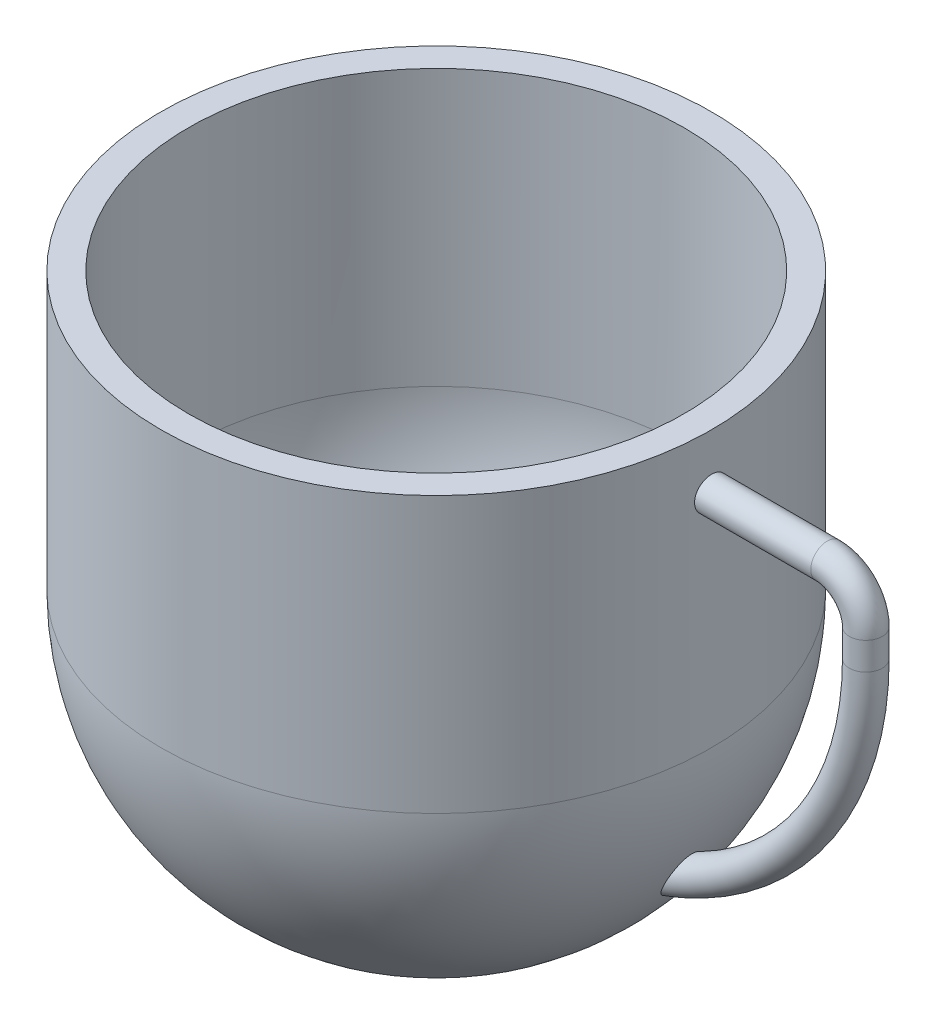
ISO-10303-21;
HEADER;
FILE_DESCRIPTION(('STEP AP214'),'2;1');
FILE_NAME('part.step','',(''),(''),'','','');
FILE_SCHEMA(('AUTOMOTIVE_DESIGN { 1 0 10303 214 1 1 1 1 }'));
ENDSEC;
DATA;
#1=APPLICATION_CONTEXT('core data for automotive mechanical design processes');
#2=APPLICATION_PROTOCOL_DEFINITION('international standard','automotive_design',2000,#1);
#3=PRODUCT_CONTEXT('',#1,'mechanical');
#4=PRODUCT('Part','Part','',(#3));
#5=PRODUCT_RELATED_PRODUCT_CATEGORY('part','',(#4));
#6=PRODUCT_DEFINITION_FORMATION('','',#4);
#7=PRODUCT_DEFINITION_CONTEXT('part definition',#1,'design');
#8=PRODUCT_DEFINITION('design','',#6,#7);
#9=PRODUCT_DEFINITION_SHAPE('','',#8);
#10=(LENGTH_UNIT() NAMED_UNIT(*) SI_UNIT(.MILLI.,.METRE.));
#11=(NAMED_UNIT(*) PLANE_ANGLE_UNIT() SI_UNIT($,.RADIAN.));
#12=(NAMED_UNIT(*) SI_UNIT($,.STERADIAN.) SOLID_ANGLE_UNIT());
#13=UNCERTAINTY_MEASURE_WITH_UNIT(LENGTH_MEASURE(1.E-05),#10,'distance_accuracy_value','');
#14=(GEOMETRIC_REPRESENTATION_CONTEXT(3) GLOBAL_UNCERTAINTY_ASSIGNED_CONTEXT((#13)) GLOBAL_UNIT_ASSIGNED_CONTEXT((#10,
#11,#12)) REPRESENTATION_CONTEXT('',''));
#15=CARTESIAN_POINT('',(0.,0.,0.));
#16=DIRECTION('',(0.,0.,1.));
#17=DIRECTION('',(1.,0.,0.));
#18=AXIS2_PLACEMENT_3D('',#15,#16,#17);
#19=CARTESIAN_POINT('',(-40.1014977724918,45.,0.));
#20=DIRECTION('',(0.,-1.,0.));
#21=DIRECTION('',(0.,0.,-1.));
#22=AXIS2_PLACEMENT_3D('',#19,#20,#21);
#23=PLANE('',#22);
#24=CARTESIAN_POINT('',(-40.1014977724918,45.,0.));
#25=DIRECTION('',(0.,-1.,0.));
#26=DIRECTION('',(0.,0.,-1.));
#27=AXIS2_PLACEMENT_3D('',#24,#25,#26);
#28=CIRCLE('',#27,45.);
#29=CARTESIAN_POINT('',(-40.1014977724918,45.,-45.));
#30=VERTEX_POINT('',#29);
#31=EDGE_CURVE('E101',#30,#30,#28,.F.);
#32=ORIENTED_EDGE('',*,*,#31,.F.);
#33=EDGE_LOOP('',(#32));
#34=FACE_BOUND('',#33,.T.);
#35=CARTESIAN_POINT('',(-40.1014977724918,45.,0.));
#36=DIRECTION('',(0.,1.,0.));
#37=DIRECTION('',(0.,0.,1.));
#38=AXIS2_PLACEMENT_3D('',#35,#36,#37);
#39=CIRCLE('',#38,50.);
#40=CARTESIAN_POINT('',(-40.1014977724918,45.,50.));
#41=VERTEX_POINT('',#40);
#42=EDGE_CURVE('E10',#41,#41,#39,.T.);
#43=ORIENTED_EDGE('',*,*,#42,.T.);
#44=EDGE_LOOP('',(#43));
#45=FACE_BOUND('',#44,.T.);
#46=ADVANCED_FACE('F39',(#34,#45),#23,.F.);
#47=CARTESIAN_POINT('',(-40.1014977724918,45.,0.));
#48=DIRECTION('',(0.,1.,0.));
#49=DIRECTION('',(0.,0.,1.));
#50=AXIS2_PLACEMENT_3D('',#47,#48,#49);
#51=CYLINDRICAL_SURFACE('',#50,50.);
#52=CARTESIAN_POINT('',(9.80842108137937,35.,-3.));
#53=CARTESIAN_POINT('',(9.80842228757156,34.831651484992,-2.99999258735707));
#54=CARTESIAN_POINT('',(9.80928201143458,34.6631847629596,-2.98578177447834));
#55=CARTESIAN_POINT('',(9.8126284601874,34.3309021525766,-2.92929548415804));
#56=CARTESIAN_POINT('',(9.81511708385479,34.1670919250254,-2.88698725324678));
#57=CARTESIAN_POINT('',(9.82143843308454,33.8489836185765,-2.77552488995124));
#58=CARTESIAN_POINT('',(9.82527045434982,33.694680605116,-2.70638482254646));
#59=CARTESIAN_POINT('',(9.83384592528368,33.3999109854946,-2.54324392374022));
#60=CARTESIAN_POINT('',(9.83858916478271,33.259441200023,-2.44924882319397));
#61=CARTESIAN_POINT('',(9.84846012193941,32.9960886661017,-2.23892176408542));
#62=CARTESIAN_POINT('',(9.85358830525923,32.87322775886,-2.12256247754005));
#63=CARTESIAN_POINT('',(9.863646973824,32.6487673381792,-1.87086613571391));
#64=CARTESIAN_POINT('',(9.8685774508547,32.5471687074034,-1.73552829296343));
#65=CARTESIAN_POINT('',(9.87768906917889,32.3680513179128,-1.44959535041678));
#66=CARTESIAN_POINT('',(9.8818696549077,32.2905503813011,-1.29898906707195));
#67=CARTESIAN_POINT('',(9.88900556171962,32.1619425161186,-0.986872903133912));
#68=CARTESIAN_POINT('',(9.89196089508004,32.1108353230749,-0.825363131815116));
#69=CARTESIAN_POINT('',(9.89631009904479,32.0365256087849,-0.496232865556627));
#70=CARTESIAN_POINT('',(9.89770586370015,32.0132892367073,-0.328620038744655));
#71=CARTESIAN_POINT('',(9.89878502834491,31.9952762381356,0.00813239348195096));
#72=CARTESIAN_POINT('',(9.8984684463677,32.0004993119241,0.177271982798926));
#73=CARTESIAN_POINT('',(9.89616017436149,32.039228982085,0.512047418202575));
#74=CARTESIAN_POINT('',(9.89417064123007,32.0726991603159,0.677687494381374));
#75=CARTESIAN_POINT('',(9.88874296305051,32.166916442674,1.00099401164867));
#76=CARTESIAN_POINT('',(9.88530480997729,32.2276636979114,1.15866040855898));
#77=CARTESIAN_POINT('',(9.87736332946055,32.3747520429396,1.46166097965742));
#78=CARTESIAN_POINT('',(9.87285931472218,32.4611096560792,1.60698711402266));
#79=CARTESIAN_POINT('',(9.86329307385402,32.6569553103961,1.88109406743768));
#80=CARTESIAN_POINT('',(9.85823084195205,32.7664435907644,2.00987471537073));
#81=CARTESIAN_POINT('',(9.84810854611258,33.0056483341855,2.24744760953885));
#82=CARTESIAN_POINT('',(9.84304849816425,33.1353964038297,2.35620803529859));
#83=CARTESIAN_POINT('',(9.83350902093594,33.411326854707,2.55040788067334));
#84=CARTESIAN_POINT('',(9.82902959186826,33.5575092419497,2.63584729176061));
#85=CARTESIAN_POINT('',(9.8211571362296,33.8621787500797,2.78097741848751));
#86=CARTESIAN_POINT('',(9.81776416489078,34.0206664960248,2.84066682512985));
#87=CARTESIAN_POINT('',(9.81244925535338,34.3454386931891,2.93258076589739));
#88=CARTESIAN_POINT('',(9.81052730121248,34.5117230598908,2.96480559767352));
#89=CARTESIAN_POINT('',(9.80837414821009,34.8470908115382,3.00083606245594));
#90=CARTESIAN_POINT('',(9.80814031870359,35.0161694297883,3.00468591307));
#91=CARTESIAN_POINT('',(9.80938291313263,35.3525700810831,2.98397263230762));
#92=CARTESIAN_POINT('',(9.81085932887657,35.5198921225375,2.95940963702078));
#93=CARTESIAN_POINT('',(9.81535362373589,35.8479051017855,2.8826046361301));
#94=CARTESIAN_POINT('',(9.81837037019944,36.0086008184103,2.83038296773509));
#95=CARTESIAN_POINT('',(9.82560438936462,36.3189470245195,2.69976359803359));
#96=CARTESIAN_POINT('',(9.82982167209902,36.468597421686,2.62136567797357));
#97=CARTESIAN_POINT('',(9.83898788177296,36.7528081428951,2.4405061331126));
#98=CARTESIAN_POINT('',(9.84393770722534,36.8873495731967,2.33801486404898));
#99=CARTESIAN_POINT('',(9.85400803197269,37.1373329538843,2.11192115304356));
#100=CARTESIAN_POINT('',(9.85912853281195,37.2527747313989,1.9883185200426));
#101=CARTESIAN_POINT('',(9.8689708618736,37.4614310281652,1.72332048471518));
#102=CARTESIAN_POINT('',(9.87369217209502,37.5546169450938,1.58190253941366));
#103=CARTESIAN_POINT('',(9.88219666230186,37.7159206328346,1.28540170667705));
#104=CARTESIAN_POINT('',(9.88597984770487,37.7840385484133,1.13031889816233));
#105=CARTESIAN_POINT('',(9.89217931420951,37.8932228070233,0.810995995212355));
#106=CARTESIAN_POINT('',(9.89459651200776,37.9343072948891,0.646762123442668));
#107=CARTESIAN_POINT('',(9.89779527966352,37.988317849945,0.313712443524316));
#108=CARTESIAN_POINT('',(9.89857686411751,38.0012441684231,0.144896676278834));
#109=CARTESIAN_POINT('',(9.8984163835799,37.9985690403185,-0.192241466492349));
#110=CARTESIAN_POINT('',(9.89747702444718,37.9830123778693,-0.360564200493613));
#111=CARTESIAN_POINT('',(9.89398568167462,37.9239056790188,-0.692203138100701));
#112=CARTESIAN_POINT('',(9.89143369515035,37.8803555925468,-0.855519332750976));
#113=CARTESIAN_POINT('',(9.88500399818113,37.7665081967466,-1.17251650153881));
#114=CARTESIAN_POINT('',(9.88112629233159,37.6962109801334,-1.32619750907319));
#115=CARTESIAN_POINT('',(9.8724806912444,37.5308712881414,-1.61958098916875));
#116=CARTESIAN_POINT('',(9.86771282001731,37.435829480175,-1.75928383860883));
#117=CARTESIAN_POINT('',(9.85781442260251,37.2235338287435,-2.02097192252031));
#118=CARTESIAN_POINT('',(9.85268337780944,37.1062478028087,-2.14293102826392));
#119=CARTESIAN_POINT('',(9.84264097170471,36.8528326108917,-2.36547027124281));
#120=CARTESIAN_POINT('',(9.83772966452625,36.7166988351478,-2.46604516304507));
#121=CARTESIAN_POINT('',(9.82867629029365,36.4293075100479,-2.64302952266152));
#122=CARTESIAN_POINT('',(9.82453513725406,36.2780323141879,-2.71941035171419));
#123=CARTESIAN_POINT('',(9.81750276435452,35.9648907602909,-2.84559604482191));
#124=CARTESIAN_POINT('',(9.81461007857711,35.803037081881,-2.89543209325468));
#125=CARTESIAN_POINT('',(9.81116168385193,35.5334914934641,-2.95413467297801));
#126=CARTESIAN_POINT('',(9.81013853735397,35.4275427302629,-2.97131199106155));
#127=CARTESIAN_POINT('',(9.80876785240396,35.2144119628455,-2.99424700805968));
#128=CARTESIAN_POINT('',(9.80842031309257,35.1072299601981,-3.00000472149936));
#129=CARTESIAN_POINT('',(9.80842108137937,35.,-3.));
#130=B_SPLINE_CURVE_WITH_KNOTS('',3,(#52,#53,#54,#55,#56,#57,#58,#59,#60,#61,#62,#63,#64,#65,
#66,#67,#68,#69,#70,#71,#72,#73,#74,#75,#76,#77,#78,#79,#80,#81,#82,#83,#84,#85,#86,#87,#88,#89,
#90,#91,#92,#93,#94,#95,#96,#97,#98,#99,#100,#101,#102,#103,#104,#105,#106,#107,#108,#109,#110,
#111,#112,#113,#114,#115,#116,#117,#118,#119,#120,#121,#122,#123,#124,#125,#126,#127,#128,#129),
.UNSPECIFIED.,.T.,.F.,(4,2,2,2,2,2,2,2,2,2,2,2,2,2,2,2,2,2,2,2,2,2,2,2,2,2,2,2,2,2,2,2,2,2,2,2,
2,2,4),(0.,0.504654094410833,1.00989750469077,1.51487642839874,2.01973901987436,
2.52522249762362,3.03072695540782,3.53660438832692,4.04247675211106,4.54773407852321,
5.05298608388374,5.5575876764176,6.06219206439061,6.56712272507959,7.07205860744167,
7.5777902413209,8.08352206012947,8.58927958470435,9.0950316279961,9.59999537532429,
10.1049567040272,10.6095472529766,11.1141420188672,11.619360913985,12.1245843816075,
12.630453689427,13.1363200758289,13.6418465774614,14.147368567676,14.6520964020586,
15.1568251392307,15.6615521268507,16.1662655023595,16.6717147352076,17.1772878093688,
17.6834571183417,18.1890304689197,18.5104714230321,18.8319119682899),.UNSPECIFIED.);
#131=CARTESIAN_POINT('',(9.80842108137937,35.,-3.));
#132=VERTEX_POINT('',#131);
#133=EDGE_CURVE('E42',#132,#132,#130,.T.);
#134=ORIENTED_EDGE('',*,*,#133,.T.);
#135=EDGE_LOOP('',(#134));
#136=FACE_BOUND('',#135,.T.);
#137=ORIENTED_EDGE('',*,*,#42,.F.);
#138=EDGE_LOOP('',(#137));
#139=FACE_BOUND('',#138,.T.);
#140=CARTESIAN_POINT('',(-40.1014977724918,-5.,0.));
#141=DIRECTION('',(0.,1.,0.));
#142=DIRECTION('',(0.,0.,1.));
#143=AXIS2_PLACEMENT_3D('',#140,#141,#142);
#144=CIRCLE('',#143,50.);
#145=CARTESIAN_POINT('',(-40.1014977724918,-5.,50.));
#146=VERTEX_POINT('',#145);
#147=EDGE_CURVE('E51',#146,#146,#144,.T.);
#148=ORIENTED_EDGE('',*,*,#147,.T.);
#149=EDGE_LOOP('',(#148));
#150=FACE_BOUND('',#149,.T.);
#151=ADVANCED_FACE('F89',(#136,#139,#150),#51,.T.);
#152=CARTESIAN_POINT('',(-40.1014977724917,-5.00000000000001,0.));
#153=DIRECTION('',(0.,1.,0.));
#154=DIRECTION('',(1.,0.,0.));
#155=AXIS2_PLACEMENT_3D('',#152,#153,#154);
#156=SPHERICAL_SURFACE('',#155,50.);
#157=CARTESIAN_POINT('',(2.36685182323063,-31.3621639015179,-1.21474155482296));
#158=CARTESIAN_POINT('',(2.33339377102615,-31.4206156711443,-1.11594434784123));
#159=CARTESIAN_POINT('',(2.30318580158751,-31.4732311780174,-1.01249816781997));
#160=CARTESIAN_POINT('',(2.25097678219428,-31.5640044394216,-0.79741453632292));
#161=CARTESIAN_POINT('',(2.2289749363498,-31.602163596041,-0.685777880476854));
#162=CARTESIAN_POINT('',(2.1946716600698,-31.6615987148694,-0.455740794563823));
#163=CARTESIAN_POINT('',(2.18243657584606,-31.6827592101764,-0.337299865972679));
#164=CARTESIAN_POINT('',(2.16903730951416,-31.7059310409794,-0.0979617006950265));
#165=CARTESIAN_POINT('',(2.16786639642714,-31.7079540189412,0.0229339977395175));
#166=CARTESIAN_POINT('',(2.17636958604479,-31.6932515888475,0.254470402580145));
#167=CARTESIAN_POINT('',(2.18527683256257,-31.6778518943411,0.365227981846171));
#168=CARTESIAN_POINT('',(2.21198823950613,-31.6316034459842,0.582334638507805));
#169=CARTESIAN_POINT('',(2.22979686690689,-31.6007469354315,0.688681473414391));
#170=CARTESIAN_POINT('',(2.27871873314462,-31.5158048245661,0.921484960087241));
#171=CARTESIAN_POINT('',(2.31208249189751,-31.4577741144724,1.04602265724754));
#172=CARTESIAN_POINT('',(2.38826445985376,-31.3248022642068,1.28250993096155));
#173=CARTESIAN_POINT('',(2.43109868095901,-31.2498324800347,1.39443769798558));
#174=CARTESIAN_POINT('',(2.54249013039062,-31.0540634151513,1.64779289978154));
#175=CARTESIAN_POINT('',(2.61444449482488,-30.9269914735671,1.7828442631198));
#176=CARTESIAN_POINT('',(2.76705246249198,-30.6556480163927,2.02844775693629));
#177=CARTESIAN_POINT('',(2.84772252807425,-30.5113438963308,2.13895227658724));
#178=CARTESIAN_POINT('',(2.99354761094856,-30.2485724566808,2.31275210925573));
#179=CARTESIAN_POINT('',(3.05755438367211,-30.1326371895259,2.38094798054601));
#180=CARTESIAN_POINT('',(3.18763171868377,-29.8956850797717,2.50565214589872));
#181=CARTESIAN_POINT('',(3.25370324454609,-29.7746658552516,2.56215488637773));
#182=CARTESIAN_POINT('',(3.3872328593857,-29.5286407282985,2.6642679574471));
#183=CARTESIAN_POINT('',(3.45469278675742,-29.4036294005972,2.70986268197537));
#184=CARTESIAN_POINT('',(3.5903432638349,-29.1507219232479,2.79067822049346));
#185=CARTESIAN_POINT('',(3.65853377646318,-29.0228259196377,2.82589955837616));
#186=CARTESIAN_POINT('',(3.81753270173147,-28.7227528440585,2.89635115178366));
#187=CARTESIAN_POINT('',(3.90845752134334,-28.5497503491889,2.92783061539403));
#188=CARTESIAN_POINT('',(4.09002527304536,-28.2013511856449,2.97417955517934));
#189=CARTESIAN_POINT('',(4.18066809255123,-28.0259536819291,2.98904308021307));
#190=CARTESIAN_POINT('',(4.36102389096534,-27.6739513824107,3.00254373700256));
#191=CARTESIAN_POINT('',(4.45073636874454,-27.4973460131589,3.0011725364765));
#192=CARTESIAN_POINT('',(4.62855867474284,-27.1442430483086,2.98223062204596));
#193=CARTESIAN_POINT('',(4.71666893801279,-26.9677454364205,2.96466437465449));
#194=CARTESIAN_POINT('',(4.87653715551445,-26.6447127502759,2.9172312238169));
#195=CARTESIAN_POINT('',(4.94862317558161,-26.4979750300156,2.88983072976635));
#196=CARTESIAN_POINT('',(5.09089132626545,-26.2062659971974,2.82306509808707));
#197=CARTESIAN_POINT('',(5.16107326200354,-26.0612948662758,2.78369874077432));
#198=CARTESIAN_POINT('',(5.29893782213588,-25.7744609208527,2.69250129276633));
#199=CARTESIAN_POINT('',(5.36662513089956,-25.6325925078255,2.64069509836651));
#200=CARTESIAN_POINT('',(5.49904693534462,-25.3530860351672,2.52379266970333));
#201=CARTESIAN_POINT('',(5.56378297410793,-25.2154457774003,2.45870348030143));
#202=CARTESIAN_POINT('',(5.70355497647905,-24.9162347496809,2.29814872604962));
#203=CARTESIAN_POINT('',(5.77769987228327,-24.7561090668689,2.19914852039385));
#204=CARTESIAN_POINT('',(5.91857376716742,-24.449514899494,1.97737790724117));
#205=CARTESIAN_POINT('',(5.98531146100398,-24.3030304357665,1.85463584303978));
#206=CARTESIAN_POINT('',(6.09295918146451,-24.0651610621836,1.61700763750033));
#207=CARTESIAN_POINT('',(6.13615573129295,-23.9691548291375,1.50782383680991));
#208=CARTESIAN_POINT('',(6.21475632645367,-23.793710217727,1.27429966254489));
#209=CARTESIAN_POINT('',(6.25017258760842,-23.714245877389,1.1499835322096));
#210=CARTESIAN_POINT('',(6.30414200350778,-23.5927723577378,0.916148010261146));
#211=CARTESIAN_POINT('',(6.32469086916808,-23.5463691666118,0.809389443776511));
#212=CARTESIAN_POINT('',(6.35834063990187,-23.4702577907446,0.588933439388094));
#213=CARTESIAN_POINT('',(6.37144782021087,-23.4405355399675,0.475241937583697));
#214=CARTESIAN_POINT('',(6.38925465793698,-23.4001325447827,0.24310714545916));
#215=CARTESIAN_POINT('',(6.39390388819086,-23.3895660100076,0.124639631425891));
#216=CARTESIAN_POINT('',(6.39421025234914,-23.3888701825868,-0.112364317106835));
#217=CARTESIAN_POINT('',(6.38986841314334,-23.3987385560253,-0.230900742189997));
#218=CARTESIAN_POINT('',(6.37337999629064,-23.4361525676269,-0.453491015276546));
#219=CARTESIAN_POINT('',(6.36196910532469,-23.462031642551,-0.557889668085098));
#220=CARTESIAN_POINT('',(6.33280936361999,-23.5280187698766,-0.761107586040868));
#221=CARTESIAN_POINT('',(6.31505795820391,-23.5681325575902,-0.859924583651999));
#222=CARTESIAN_POINT('',(6.26592853086548,-23.6788372633682,-1.08886142950339));
#223=CARTESIAN_POINT('',(6.23194087875116,-23.7551986210318,-1.21562832032603));
#224=CARTESIAN_POINT('',(6.15582698396559,-23.9253410486851,-1.45410243875196));
#225=CARTESIAN_POINT('',(6.11368295256752,-24.0191601757966,-1.56577582706339));
#226=CARTESIAN_POINT('',(6.00202354047944,-24.2663059099796,-1.82321998169622));
#227=CARTESIAN_POINT('',(5.92893543595646,-24.4269181101764,-1.96045121942669));
#228=CARTESIAN_POINT('',(5.81262232800559,-24.6801265590547,-2.14446103691651));
#229=CARTESIAN_POINT('',(5.77267724146548,-24.766707453812,-2.20222355887092));
#230=CARTESIAN_POINT('',(5.69086861745688,-24.9432013798254,-2.31090478925553));
#231=CARTESIAN_POINT('',(5.64900552703741,-25.0331136336819,-2.36182508170229));
#232=CARTESIAN_POINT('',(5.5421177357069,-25.2615850893335,-2.48125951958151));
#233=CARTESIAN_POINT('',(5.4760643265195,-25.401799276013,-2.54568718091045));
#234=CARTESIAN_POINT('',(5.34101694757757,-25.6863517519179,-2.66098747598898));
#235=CARTESIAN_POINT('',(5.27202154610065,-25.8306920375859,-2.71185342054304));
#236=CARTESIAN_POINT('',(5.1316146802185,-26.1222378850899,-2.800854623802));
#237=CARTESIAN_POINT('',(5.06020118037659,-26.2694458141635,-2.83897884821951));
#238=CARTESIAN_POINT('',(4.9154838599948,-26.5655292485963,-2.90301377290536));
#239=CARTESIAN_POINT('',(4.84218032745359,-26.7144044979603,-2.9289263224943));
#240=CARTESIAN_POINT('',(4.69138781729493,-27.0183759400924,-2.96964036551142));
#241=CARTESIAN_POINT('',(4.61384328393594,-27.1735026566941,-2.98400687566681));
#242=CARTESIAN_POINT('',(4.45753267266801,-27.4838093375329,-3.00022895272352));
#243=CARTESIAN_POINT('',(4.3787664758206,-27.638989305498,-3.00208329370652));
#244=CARTESIAN_POINT('',(4.22045773976511,-27.9485268385973,-2.99325968321055));
#245=CARTESIAN_POINT('',(4.14091549157463,-28.1028846808162,-2.9825862630632));
#246=CARTESIAN_POINT('',(3.98148055585738,-28.4099906204337,-2.94848710202077));
#247=CARTESIAN_POINT('',(3.90158792423138,-28.5627389622667,-2.92506332682425));
#248=CARTESIAN_POINT('',(3.75250971460854,-28.845706771859,-2.86898327152443));
#249=CARTESIAN_POINT('',(3.68330313637057,-28.9762380812403,-2.83795423594136));
#250=CARTESIAN_POINT('',(3.54542038410657,-29.2347117824637,-2.7655102727417));
#251=CARTESIAN_POINT('',(3.476744261522,-29.3626539251204,-2.72409435056366));
#252=CARTESIAN_POINT('',(3.34048484914066,-29.6150014979831,-2.63032159763962));
#253=CARTESIAN_POINT('',(3.27290100343819,-29.739408753357,-2.57797053409569));
#254=CARTESIAN_POINT('',(3.13950461038493,-29.9835730037165,-2.4616095371304));
#255=CARTESIAN_POINT('',(3.07369125498367,-30.1033321315457,-2.39760502961954));
#256=CARTESIAN_POINT('',(2.92334097557532,-30.3754536627599,-2.23379612178189));
#257=CARTESIAN_POINT('',(2.8398038505227,-30.525511765559,-2.12915085659554));
#258=CARTESIAN_POINT('',(2.68060606004607,-30.8096582532967,-1.89553267889366));
#259=CARTESIAN_POINT('',(2.60491780495336,-30.9438028334046,-1.76664979592963));
#260=CARTESIAN_POINT('',(2.50453796735331,-31.1207760297676,-1.56163988262347));
#261=CARTESIAN_POINT('',(2.47485807857124,-31.1729634260235,-1.49593516315151));
#262=CARTESIAN_POINT('',(2.41846779750364,-31.271902206488,-1.35926174556061));
#263=CARTESIAN_POINT('',(2.39175923450974,-31.3186502427676,-1.28828984904171));
#264=CARTESIAN_POINT('',(2.36685182323063,-31.3621639015179,-1.21474155482296));
#265=B_SPLINE_CURVE_WITH_KNOTS('',3,(#157,#158,#159,#160,#161,#162,#163,#164,#165,#166,#167,
#168,#169,#170,#171,#172,#173,#174,#175,#176,#177,#178,#179,#180,#181,#182,#183,#184,#185,#186,
#187,#188,#189,#190,#191,#192,#193,#194,#195,#196,#197,#198,#199,#200,#201,#202,#203,#204,#205,
#206,#207,#208,#209,#210,#211,#212,#213,#214,#215,#216,#217,#218,#219,#220,#221,#222,#223,#224,
#225,#226,#227,#228,#229,#230,#231,#232,#233,#234,#235,#236,#237,#238,#239,#240,#241,#242,#243,
#244,#245,#246,#247,#248,#249,#250,#251,#252,#253,#254,#255,#256,#257,#258,#259,#260,#261,#262,
#263,#264),.UNSPECIFIED.,.T.,.F.,(4,2,2,2,2,2,2,2,2,2,2,2,2,2,2,2,2,2,2,2,2,2,2,2,2,2,2,2,2,2,2,
2,2,2,2,2,2,2,2,2,2,2,2,2,2,2,2,2,2,2,2,2,2,4),(0.,0.358479558179919,0.716924339343617,
1.07778381640812,1.43842374751829,1.77336494173791,2.10847438831741,2.53031530526211,
2.9528749665944,3.5463256598261,4.14091754432209,4.58721844150093,5.0337308226383,
5.48087825757185,5.92800310609737,6.52109534509911,7.11439993719466,7.70800904908315,
8.30145449550363,8.79834335634251,9.29528288220565,9.79123603479462,10.2869268306603,
10.8923161192808,11.4969870988752,11.9505474926965,12.4033905797288,12.7566171884442,
13.1095454931025,13.4645711813909,13.8195563236518,14.142671723054,14.4659174570616,
14.9188893464804,15.3728605142717,16.0395345937954,16.3738078742964,16.7080036347373,
17.2108242749983,17.7138924701363,18.2173951986002,18.7208216527258,19.242425860063,
19.7640811724369,20.2855478585325,20.8069341738371,21.2594833587704,21.712075892586,
22.1644303287211,22.6165746821479,23.2181368518276,23.8175071675748,24.0842093100683,
24.3510747491014),.UNSPECIFIED.);
#266=CARTESIAN_POINT('',(2.36685182323063,-31.3621639015179,-1.21474155482296));
#267=VERTEX_POINT('',#266);
#268=EDGE_CURVE('E60',#267,#267,#265,.T.);
#269=ORIENTED_EDGE('',*,*,#268,.T.);
#270=EDGE_LOOP('',(#269));
#271=FACE_BOUND('',#270,.T.);
#272=ORIENTED_EDGE('',*,*,#147,.F.);
#273=EDGE_LOOP('',(#272));
#274=FACE_BOUND('',#273,.T.);
#275=CARTESIAN_POINT('',(-40.1014977724918,-45.,0.));
#276=DIRECTION('',(0.,1.,0.));
#277=DIRECTION('',(0.,0.,1.));
#278=AXIS2_PLACEMENT_3D('',#275,#276,#277);
#279=CIRCLE('',#278,30.);
#280=CARTESIAN_POINT('',(-40.1014977724918,-45.,30.));
#281=VERTEX_POINT('',#280);
#282=EDGE_CURVE('E57',#281,#281,#279,.T.);
#283=ORIENTED_EDGE('',*,*,#282,.T.);
#284=EDGE_LOOP('',(#283));
#285=FACE_BOUND('',#284,.T.);
#286=ADVANCED_FACE('F69',(#271,#274,#285),#156,.T.);
#287=CARTESIAN_POINT('',(-40.1014977724918,-45.,0.));
#288=DIRECTION('',(0.,1.,0.));
#289=DIRECTION('',(0.,0.,1.));
#290=AXIS2_PLACEMENT_3D('',#287,#288,#289);
#291=PLANE('',#290);
#292=CARTESIAN_POINT('',(-40.1014977724918,-45.,0.));
#293=DIRECTION('',(0.,-1.,0.));
#294=DIRECTION('',(0.,0.,-1.));
#295=AXIS2_PLACEMENT_3D('',#292,#293,#294);
#296=CIRCLE('',#295,28.);
#297=CARTESIAN_POINT('',(-40.1014977724918,-45.,-28.));
#298=VERTEX_POINT('',#297);
#299=EDGE_CURVE('E110',#298,#298,#296,.T.);
#300=ORIENTED_EDGE('',*,*,#299,.F.);
#301=EDGE_LOOP('',(#300));
#302=FACE_BOUND('',#301,.T.);
#303=ORIENTED_EDGE('',*,*,#282,.F.);
#304=EDGE_LOOP('',(#303));
#305=FACE_BOUND('',#304,.T.);
#306=ADVANCED_FACE('F81',(#302,#305),#291,.F.);
#307=CARTESIAN_POINT('',(7.89850222750824,35.,0.));
#308=DIRECTION('',(1.,0.,0.));
#309=DIRECTION('',(0.,0.,-1.));
#310=AXIS2_PLACEMENT_3D('',#307,#308,#309);
#311=CYLINDRICAL_SURFACE('',#310,3.);
#312=CARTESIAN_POINT('',(30.8985022275082,35.,0.));
#313=DIRECTION('',(1.,0.,0.));
#314=DIRECTION('',(0.,0.,-1.));
#315=AXIS2_PLACEMENT_3D('',#312,#313,#314);
#316=CIRCLE('',#315,3.);
#317=CARTESIAN_POINT('',(30.8985022275082,37.9999999999999,0.));
#318=VERTEX_POINT('',#317);
#319=EDGE_CURVE('E121',#318,#318,#316,.T.);
#320=ORIENTED_EDGE('',*,*,#319,.F.);
#321=EDGE_LOOP('',(#320));
#322=FACE_BOUND('',#321,.T.);
#323=ORIENTED_EDGE('',*,*,#133,.F.);
#324=EDGE_LOOP('',(#323));
#325=FACE_BOUND('',#324,.T.);
#326=ADVANCED_FACE('F77',(#322,#325),#311,.T.);
#327=CARTESIAN_POINT('',(-17.1014977724918,23.,0.));
#328=DIRECTION('',(0.,0.,-1.));
#329=DIRECTION('',(-1.,0.,0.));
#330=AXIS2_PLACEMENT_3D('',#327,#328,#329);
#331=TOROIDAL_SURFACE('',#330,55.,3.);
#332=CARTESIAN_POINT('',(37.8985022275082,23.,0.));
#333=DIRECTION('',(0.,-1.,0.));
#334=DIRECTION('',(0.,0.,-1.));
#335=AXIS2_PLACEMENT_3D('',#332,#333,#334);
#336=CIRCLE('',#335,3.);
#337=CARTESIAN_POINT('',(37.8985022275082,23.,-3.));
#338=VERTEX_POINT('',#337);
#339=EDGE_CURVE('E68',#338,#338,#336,.T.);
#340=ORIENTED_EDGE('',*,*,#339,.T.);
#341=EDGE_LOOP('',(#340));
#342=FACE_BOUND('',#341,.T.);
#343=ORIENTED_EDGE('',*,*,#268,.F.);
#344=EDGE_LOOP('',(#343));
#345=FACE_BOUND('',#344,.T.);
#346=ADVANCED_FACE('F72',(#342,#345),#331,.T.);
#347=CARTESIAN_POINT('',(30.8985022275082,28.,0.));
#348=DIRECTION('',(0.,0.,-1.));
#349=DIRECTION('',(-1.,0.,0.));
#350=AXIS2_PLACEMENT_3D('',#347,#348,#349);
#351=TOROIDAL_SURFACE('',#350,6.99999999999994,3.);
#352=CARTESIAN_POINT('',(37.8985022275082,28.,0.));
#353=DIRECTION('',(0.,-1.,0.));
#354=DIRECTION('',(0.,0.,-1.));
#355=AXIS2_PLACEMENT_3D('',#352,#353,#354);
#356=CIRCLE('',#355,3.);
#357=CARTESIAN_POINT('',(40.8985022275082,28.,0.));
#358=VERTEX_POINT('',#357);
#359=EDGE_CURVE('E128',#358,#358,#356,.T.);
#360=CARTESIAN_POINT('',(30.8985022275082,28.,0.));
#361=DIRECTION('',(0.,0.,-1.));
#362=DIRECTION('',(-1.,0.,0.));
#363=AXIS2_PLACEMENT_3D('',#360,#361,#362);
#364=CIRCLE('',#363,9.99999999999994);
#365=EDGE_CURVE('',#318,#358,#364,.T.);
#366=ORIENTED_EDGE('',*,*,#319,.T.);
#367=ORIENTED_EDGE('',*,*,#359,.F.);
#368=ORIENTED_EDGE('',*,*,#365,.T.);
#369=ORIENTED_EDGE('',*,*,#365,.F.);
#370=EDGE_LOOP('',(#366,#368,#367,#369));
#371=FACE_BOUND('',#370,.T.);
#372=ADVANCED_FACE('F76',(#371),#351,.T.);
#373=CARTESIAN_POINT('',(37.8985022275082,28.,0.));
#374=DIRECTION('',(0.,-1.,0.));
#375=DIRECTION('',(0.,0.,-1.));
#376=AXIS2_PLACEMENT_3D('',#373,#374,#375);
#377=CYLINDRICAL_SURFACE('',#376,3.);
#378=ORIENTED_EDGE('',*,*,#339,.F.);
#379=EDGE_LOOP('',(#378));
#380=FACE_BOUND('',#379,.T.);
#381=ORIENTED_EDGE('',*,*,#359,.T.);
#382=EDGE_LOOP('',(#381));
#383=FACE_BOUND('',#382,.T.);
#384=ADVANCED_FACE('F79',(#380,#383),#377,.T.);
#385=CARTESIAN_POINT('',(-40.1014977724918,-43.,0.));
#386=DIRECTION('',(0.,-1.,0.));
#387=DIRECTION('',(0.,0.,-1.));
#388=AXIS2_PLACEMENT_3D('',#385,#386,#387);
#389=CYLINDRICAL_SURFACE('',#388,28.);
#390=CARTESIAN_POINT('',(-40.1014977724918,-43.,0.));
#391=DIRECTION('',(0.,-1.,0.));
#392=DIRECTION('',(0.,0.,-1.));
#393=AXIS2_PLACEMENT_3D('',#390,#391,#392);
#394=CIRCLE('',#393,28.);
#395=CARTESIAN_POINT('',(-40.1014977724918,-43.,-28.));
#396=VERTEX_POINT('',#395);
#397=EDGE_CURVE('E117',#396,#396,#394,.T.);
#398=ORIENTED_EDGE('',*,*,#397,.F.);
#399=EDGE_LOOP('',(#398));
#400=FACE_BOUND('',#399,.T.);
#401=ORIENTED_EDGE('',*,*,#299,.T.);
#402=EDGE_LOOP('',(#401));
#403=FACE_BOUND('',#402,.T.);
#404=ADVANCED_FACE('F151',(#400,#403),#389,.F.);
#405=CARTESIAN_POINT('',(-40.1014977724918,-43.,0.));
#406=DIRECTION('',(0.,-1.,0.));
#407=DIRECTION('',(0.,0.,-1.));
#408=AXIS2_PLACEMENT_3D('',#405,#406,#407);
#409=PLANE('',#408);
#410=ORIENTED_EDGE('',*,*,#397,.T.);
#411=EDGE_LOOP('',(#410));
#412=FACE_BOUND('',#411,.T.);
#413=ADVANCED_FACE('F160',(#412),#409,.T.);
#414=CARTESIAN_POINT('',(-40.1014977724918,-43.,0.));
#415=DIRECTION('',(0.,-1.,0.));
#416=DIRECTION('',(0.,0.,-1.));
#417=AXIS2_PLACEMENT_3D('',#414,#415,#416);
#418=CYLINDRICAL_SURFACE('',#417,33.);
#419=CARTESIAN_POINT('',(-40.1014977724918,-35.,0.));
#420=DIRECTION('',(0.,-1.,0.));
#421=DIRECTION('',(0.,0.,-1.));
#422=AXIS2_PLACEMENT_3D('',#419,#420,#421);
#423=CIRCLE('',#422,33.);
#424=CARTESIAN_POINT('',(-40.1014977724918,-35.,-33.));
#425=VERTEX_POINT('',#424);
#426=EDGE_CURVE('E113',#425,#425,#423,.T.);
#427=ORIENTED_EDGE('',*,*,#426,.T.);
#428=EDGE_LOOP('',(#427));
#429=FACE_BOUND('',#428,.T.);
#430=CARTESIAN_POINT('',(-40.1014977724918,-35.5941170815567,0.));
#431=DIRECTION('',(0.,1.,0.));
#432=DIRECTION('',(0.,0.,1.));
#433=AXIS2_PLACEMENT_3D('',#430,#431,#432);
#434=CIRCLE('',#433,33.);
#435=CARTESIAN_POINT('',(-40.1014977724918,-35.5941170815567,33.));
#436=VERTEX_POINT('',#435);
#437=EDGE_CURVE('E104',#436,#436,#434,.F.);
#438=ORIENTED_EDGE('',*,*,#437,.F.);
#439=EDGE_LOOP('',(#438));
#440=FACE_BOUND('',#439,.T.);
#441=ADVANCED_FACE('F166',(#429,#440),#418,.T.);
#442=CARTESIAN_POINT('',(-40.1014977724918,45.,0.));
#443=DIRECTION('',(0.,1.,0.));
#444=DIRECTION('',(0.,0.,1.));
#445=AXIS2_PLACEMENT_3D('',#442,#443,#444);
#446=CYLINDRICAL_SURFACE('',#445,45.);
#447=ORIENTED_EDGE('',*,*,#31,.T.);
#448=EDGE_LOOP('',(#447));
#449=FACE_BOUND('',#448,.T.);
#450=CARTESIAN_POINT('',(-40.1014977724918,-5.,0.));
#451=DIRECTION('',(0.,1.,0.));
#452=DIRECTION('',(0.,0.,1.));
#453=AXIS2_PLACEMENT_3D('',#450,#451,#452);
#454=CIRCLE('',#453,45.);
#455=CARTESIAN_POINT('',(-40.1014977724918,-5.,45.));
#456=VERTEX_POINT('',#455);
#457=EDGE_CURVE('E105',#456,#456,#454,.T.);
#458=ORIENTED_EDGE('',*,*,#457,.F.);
#459=EDGE_LOOP('',(#458));
#460=FACE_BOUND('',#459,.T.);
#461=ADVANCED_FACE('F180',(#449,#460),#446,.F.);
#462=CARTESIAN_POINT('',(-40.1014977724917,-5.00000000000001,0.));
#463=DIRECTION('',(0.,1.,0.));
#464=DIRECTION('',(1.,0.,0.));
#465=AXIS2_PLACEMENT_3D('',#462,#463,#464);
#466=SPHERICAL_SURFACE('',#465,45.);
#467=ORIENTED_EDGE('',*,*,#437,.T.);
#468=EDGE_LOOP('',(#467));
#469=FACE_BOUND('',#468,.T.);
#470=ORIENTED_EDGE('',*,*,#457,.T.);
#471=EDGE_LOOP('',(#470));
#472=FACE_BOUND('',#471,.T.);
#473=ADVANCED_FACE('F176',(#469,#472),#466,.F.);
#474=CARTESIAN_POINT('',(-40.1014977724918,-35.,0.));
#475=DIRECTION('',(0.,-1.,0.));
#476=DIRECTION('',(0.,0.,-1.));
#477=AXIS2_PLACEMENT_3D('',#474,#475,#476);
#478=PLANE('',#477);
#479=ORIENTED_EDGE('',*,*,#426,.F.);
#480=EDGE_LOOP('',(#479));
#481=FACE_BOUND('',#480,.T.);
#482=ADVANCED_FACE('F173',(#481),#478,.F.);
#483=CLOSED_SHELL('',(#46,#151,#286,#306,#326,#346,#372,#384,#404,#413,#441,#461,#473,#482));
#484=MANIFOLD_SOLID_BREP('B2',#483);
#485=ADVANCED_BREP_SHAPE_REPRESENTATION('',(#18,#484),#14);
#486=SHAPE_DEFINITION_REPRESENTATION(#9,#485);
ENDSEC;
END-ISO-10303-21;
